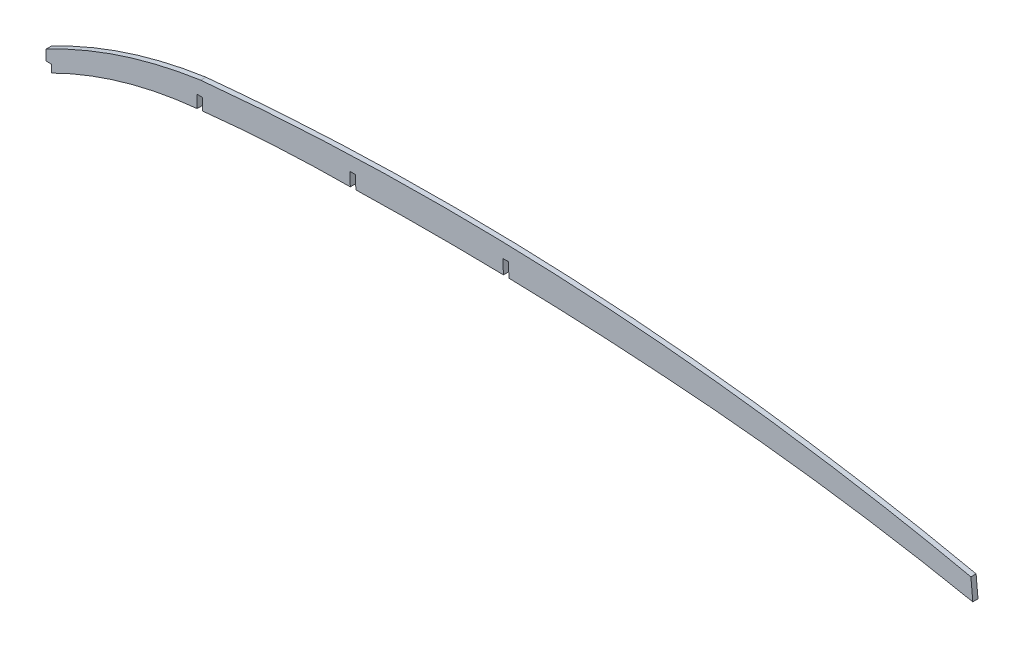
ISO-10303-21;
HEADER;
FILE_DESCRIPTION(('STEP AP214'),'2;1');
FILE_NAME('part.step','',(''),(''),'','','');
FILE_SCHEMA(('AUTOMOTIVE_DESIGN { 1 0 10303 214 1 1 1 1 }'));
ENDSEC;
DATA;
#1=APPLICATION_CONTEXT('core data for automotive mechanical design processes');
#2=APPLICATION_PROTOCOL_DEFINITION('international standard','automotive_design',2000,#1);
#3=PRODUCT_CONTEXT('',#1,'mechanical');
#4=PRODUCT('Part','Part','',(#3));
#5=PRODUCT_RELATED_PRODUCT_CATEGORY('part','',(#4));
#6=PRODUCT_DEFINITION_FORMATION('','',#4);
#7=PRODUCT_DEFINITION_CONTEXT('part definition',#1,'design');
#8=PRODUCT_DEFINITION('design','',#6,#7);
#9=PRODUCT_DEFINITION_SHAPE('','',#8);
#10=(LENGTH_UNIT() NAMED_UNIT(*) SI_UNIT(.MILLI.,.METRE.));
#11=(NAMED_UNIT(*) PLANE_ANGLE_UNIT() SI_UNIT($,.RADIAN.));
#12=(NAMED_UNIT(*) SI_UNIT($,.STERADIAN.) SOLID_ANGLE_UNIT());
#13=UNCERTAINTY_MEASURE_WITH_UNIT(LENGTH_MEASURE(1.E-05),#10,'distance_accuracy_value','');
#14=(GEOMETRIC_REPRESENTATION_CONTEXT(3) GLOBAL_UNCERTAINTY_ASSIGNED_CONTEXT((#13)) GLOBAL_UNIT_ASSIGNED_CONTEXT((#10,
#11,#12)) REPRESENTATION_CONTEXT('',''));
#15=CARTESIAN_POINT('',(0.,0.,0.));
#16=DIRECTION('',(0.,0.,1.));
#17=DIRECTION('',(1.,0.,0.));
#18=AXIS2_PLACEMENT_3D('',#15,#16,#17);
#19=CARTESIAN_POINT('',(236.842908731336,-1854.33256999703,-1.5875));
#20=DIRECTION('',(0.,0.,1.));
#21=DIRECTION('',(1.,0.,0.));
#22=AXIS2_PLACEMENT_3D('',#19,#20,#21);
#23=CYLINDRICAL_SURFACE('',#22,1973.72186122721);
#24=DIRECTION('',(0.,0.,1.));
#25=VECTOR('',#24,1.);
#26=CARTESIAN_POINT('',(189.230121553562,118.814917643811,-1.5875));
#27=LINE('',#26,#25);
#28=CARTESIAN_POINT('',(189.230121553562,118.814917643811,-1.5875));
#29=VERTEX_POINT('',#28);
#30=CARTESIAN_POINT('',(189.230121553562,118.814917643811,1.5875));
#31=VERTEX_POINT('',#30);
#32=EDGE_CURVE('E61',#29,#31,#27,.T.);
#33=ORIENTED_EDGE('',*,*,#32,.F.);
#34=CARTESIAN_POINT('',(236.842908731336,-1854.33256999703,-1.5875));
#35=DIRECTION('',(0.,0.,1.));
#36=DIRECTION('',(1.,0.,0.));
#37=AXIS2_PLACEMENT_3D('',#34,#35,#36);
#38=CIRCLE('',#37,1973.72186122721);
#39=CARTESIAN_POINT('',(279.388983423048,118.930670681853,-1.5875));
#40=VERTEX_POINT('',#39);
#41=EDGE_CURVE('E430',#29,#40,#38,.F.);
#42=ORIENTED_EDGE('',*,*,#41,.T.);
#43=DIRECTION('',(0.,0.,1.));
#44=VECTOR('',#43,1.);
#45=CARTESIAN_POINT('',(279.388983423048,118.930670681852,-1.5875));
#46=LINE('',#45,#44);
#47=CARTESIAN_POINT('',(279.388983423048,118.930670681853,1.5875));
#48=VERTEX_POINT('',#47);
#49=EDGE_CURVE('E238',#48,#40,#46,.F.);
#50=ORIENTED_EDGE('',*,*,#49,.F.);
#51=CARTESIAN_POINT('',(236.842908731336,-1854.33256999703,1.5875));
#52=DIRECTION('',(0.,0.,1.));
#53=DIRECTION('',(1.,0.,0.));
#54=AXIS2_PLACEMENT_3D('',#51,#52,#53);
#55=CIRCLE('',#54,1973.72186122721);
#56=EDGE_CURVE('E346',#31,#48,#55,.F.);
#57=ORIENTED_EDGE('',*,*,#56,.F.);
#58=EDGE_LOOP('',(#33,#42,#50,#57));
#59=FACE_BOUND('',#58,.T.);
#60=ADVANCED_FACE('F38',(#59),#23,.F.);
#61=CARTESIAN_POINT('',(569.494875015018,51.9104708992244,-1.5875));
#62=DIRECTION('',(0.995871386262185,0.0907754483560017,0.));
#63=DIRECTION('',(-0.0907754483560017,0.995871386262185,0.));
#64=AXIS2_PLACEMENT_3D('',#61,#62,#63);
#65=PLANE('',#64);
#66=DIRECTION('',(-0.0907754483560017,0.995871386262185,0.));
#67=VECTOR('',#66,1.);
#68=CARTESIAN_POINT('',(569.494875015018,51.9104708992244,1.5875));
#69=LINE('',#68,#67);
#70=CARTESIAN_POINT('',(566.085246421807,89.3165274404584,1.5875));
#71=VERTEX_POINT('',#70);
#72=CARTESIAN_POINT('',(564.932089986396,101.967475672689,1.5875));
#73=VERTEX_POINT('',#72);
#74=EDGE_CURVE('E269',#71,#73,#69,.T.);
#75=ORIENTED_EDGE('',*,*,#74,.F.);
#76=DIRECTION('',(0.,0.,1.));
#77=VECTOR('',#76,1.);
#78=CARTESIAN_POINT('',(566.085246421807,89.3165274404584,-1.5875));
#79=LINE('',#78,#77);
#80=CARTESIAN_POINT('',(566.085246421807,89.3165274404584,-1.5875));
#81=VERTEX_POINT('',#80);
#82=EDGE_CURVE('E318',#81,#71,#79,.T.);
#83=ORIENTED_EDGE('',*,*,#82,.F.);
#84=DIRECTION('',(-0.0907754483560017,0.995871386262185,0.));
#85=VECTOR('',#84,1.);
#86=CARTESIAN_POINT('',(569.494875015018,51.9104708992244,-1.5875));
#87=LINE('',#86,#85);
#88=CARTESIAN_POINT('',(564.932089986396,101.967475672689,-1.5875));
#89=VERTEX_POINT('',#88);
#90=EDGE_CURVE('E354',#81,#89,#87,.T.);
#91=ORIENTED_EDGE('',*,*,#90,.T.);
#92=DIRECTION('',(0.,0.,1.));
#93=VECTOR('',#92,1.);
#94=CARTESIAN_POINT('',(564.932089986396,101.967475672689,-1.5875));
#95=LINE('',#94,#93);
#96=EDGE_CURVE('E366',#89,#73,#95,.T.);
#97=ORIENTED_EDGE('',*,*,#96,.T.);
#98=EDGE_LOOP('',(#75,#83,#91,#97));
#99=FACE_BOUND('',#98,.T.);
#100=ADVANCED_FACE('F40',(#99),#65,.T.);
#101=CARTESIAN_POINT('',(283.231887302239,-1315.95982074918,-1.5875));
#102=DIRECTION('',(0.,0.,1.));
#103=DIRECTION('',(1.,0.,0.));
#104=AXIS2_PLACEMENT_3D('',#101,#102,#103);
#105=CYLINDRICAL_SURFACE('',#104,1433.46002300254);
#106=CARTESIAN_POINT('',(283.231887302239,-1315.95982074918,1.5875));
#107=DIRECTION('',(0.,0.,1.));
#108=DIRECTION('',(1.,0.,0.));
#109=AXIS2_PLACEMENT_3D('',#106,#107,#108);
#110=CIRCLE('',#109,1433.46002300254);
#111=CARTESIAN_POINT('',(373.10105505159,114.680305290374,1.5875));
#112=VERTEX_POINT('',#111);
#113=EDGE_CURVE('E351',#112,#71,#110,.F.);
#114=ORIENTED_EDGE('',*,*,#113,.F.);
#115=DIRECTION('',(0.,0.,1.));
#116=VECTOR('',#115,1.);
#117=CARTESIAN_POINT('',(373.10105505159,114.680305290374,-1.5875));
#118=LINE('',#117,#116);
#119=CARTESIAN_POINT('',(373.10105505159,114.680305290374,-1.5875));
#120=VERTEX_POINT('',#119);
#121=EDGE_CURVE('E356',#120,#112,#118,.T.);
#122=ORIENTED_EDGE('',*,*,#121,.F.);
#123=CARTESIAN_POINT('',(283.231887302239,-1315.95982074918,-1.5875));
#124=DIRECTION('',(0.,0.,1.));
#125=DIRECTION('',(1.,0.,0.));
#126=AXIS2_PLACEMENT_3D('',#123,#124,#125);
#127=CIRCLE('',#126,1433.46002300254);
#128=EDGE_CURVE('E432',#120,#81,#127,.F.);
#129=ORIENTED_EDGE('',*,*,#128,.T.);
#130=ORIENTED_EDGE('',*,*,#82,.T.);
#131=EDGE_LOOP('',(#114,#122,#129,#130));
#132=FACE_BOUND('',#131,.T.);
#133=ADVANCED_FACE('F400',(#132),#105,.F.);
#134=DIRECTION('',(0.,0.,1.));
#135=VECTOR('',#134,1.);
#136=CARTESIAN_POINT('',(282.773576797099,118.854790396613,-1.5875));
#137=LINE('',#136,#135);
#138=CARTESIAN_POINT('',(282.773576797099,118.854790396613,-1.5875));
#139=VERTEX_POINT('',#138);
#140=CARTESIAN_POINT('',(282.773576797099,118.854790396613,1.5875));
#141=VERTEX_POINT('',#140);
#142=EDGE_CURVE('E53',#139,#141,#137,.T.);
#143=ORIENTED_EDGE('',*,*,#142,.F.);
#144=EDGE_CURVE('E433',#139,#120,#38,.F.);
#145=ORIENTED_EDGE('',*,*,#144,.T.);
#146=ORIENTED_EDGE('',*,*,#121,.T.);
#147=EDGE_CURVE('E343',#141,#112,#55,.F.);
#148=ORIENTED_EDGE('',*,*,#147,.F.);
#149=EDGE_LOOP('',(#143,#145,#146,#148));
#150=FACE_BOUND('',#149,.T.);
#151=ADVANCED_FACE('F403',(#150),#23,.F.);
#152=CARTESIAN_POINT('',(190.018097922331,-770.258799072111,-1.5875));
#153=DIRECTION('',(0.,0.,1.));
#154=DIRECTION('',(1.,0.,0.));
#155=AXIS2_PLACEMENT_3D('',#152,#153,#154);
#156=CYLINDRICAL_SURFACE('',#155,889.);
#157=DIRECTION('',(0.,0.,1.));
#158=VECTOR('',#157,1.);
#159=CARTESIAN_POINT('',(95.6690999999995,113.720423868707,-1.5875));
#160=LINE('',#159,#158);
#161=CARTESIAN_POINT('',(95.6690999999995,113.720423868707,-1.5875));
#162=VERTEX_POINT('',#161);
#163=CARTESIAN_POINT('',(95.6690999999995,113.720423868707,1.5875));
#164=VERTEX_POINT('',#163);
#165=EDGE_CURVE('E255',#162,#164,#160,.T.);
#166=ORIENTED_EDGE('',*,*,#165,.F.);
#167=CARTESIAN_POINT('',(190.018097922331,-770.258799072111,-1.5875));
#168=DIRECTION('',(0.,0.,1.));
#169=DIRECTION('',(1.,0.,0.));
#170=AXIS2_PLACEMENT_3D('',#167,#168,#169);
#171=CIRCLE('',#170,889.);
#172=CARTESIAN_POINT('',(185.852928875635,118.731443487847,-1.5875));
#173=VERTEX_POINT('',#172);
#174=EDGE_CURVE('E337',#162,#173,#171,.F.);
#175=ORIENTED_EDGE('',*,*,#174,.T.);
#176=DIRECTION('',(0.,0.,1.));
#177=VECTOR('',#176,1.);
#178=CARTESIAN_POINT('',(185.852928875635,118.731443487847,-1.5875));
#179=LINE('',#178,#177);
#180=CARTESIAN_POINT('',(185.852928875635,118.731443487847,1.5875));
#181=VERTEX_POINT('',#180);
#182=EDGE_CURVE('E250',#181,#173,#179,.F.);
#183=ORIENTED_EDGE('',*,*,#182,.F.);
#184=CARTESIAN_POINT('',(190.018097922331,-770.258799072111,1.5875));
#185=DIRECTION('',(0.,0.,1.));
#186=DIRECTION('',(1.,0.,0.));
#187=AXIS2_PLACEMENT_3D('',#184,#185,#186);
#188=CIRCLE('',#187,889.);
#189=EDGE_CURVE('E341',#164,#181,#188,.F.);
#190=ORIENTED_EDGE('',*,*,#189,.F.);
#191=EDGE_LOOP('',(#166,#175,#183,#190));
#192=FACE_BOUND('',#191,.T.);
#193=ADVANCED_FACE('F339',(#192),#156,.F.);
#194=CARTESIAN_POINT('',(117.154868986009,-139.425519966293,-1.5875));
#195=DIRECTION('',(0.,0.,1.));
#196=DIRECTION('',(1.,0.,0.));
#197=AXIS2_PLACEMENT_3D('',#194,#195,#196);
#198=CYLINDRICAL_SURFACE('',#197,254.);
#199=DIRECTION('',(0.,0.,1.));
#200=VECTOR('',#199,1.);
#201=CARTESIAN_POINT('',(3.3528,87.6539575179203,-1.5875));
#202=LINE('',#201,#200);
#203=CARTESIAN_POINT('',(3.3528,87.6539575179203,-1.5875));
#204=VERTEX_POINT('',#203);
#205=CARTESIAN_POINT('',(3.3528,87.6539575179203,1.5875));
#206=VERTEX_POINT('',#205);
#207=EDGE_CURVE('E190',#204,#206,#202,.T.);
#208=ORIENTED_EDGE('',*,*,#207,.F.);
#209=CARTESIAN_POINT('',(117.154868986009,-139.425519966293,-1.5875));
#210=DIRECTION('',(0.,0.,1.));
#211=DIRECTION('',(1.,0.,0.));
#212=AXIS2_PLACEMENT_3D('',#209,#210,#211);
#213=CIRCLE('',#212,254.);
#214=CARTESIAN_POINT('',(92.2908999999994,113.354588124242,-1.5875));
#215=VERTEX_POINT('',#214);
#216=EDGE_CURVE('E440',#204,#215,#213,.F.);
#217=ORIENTED_EDGE('',*,*,#216,.T.);
#218=DIRECTION('',(0.,0.,1.));
#219=VECTOR('',#218,1.);
#220=CARTESIAN_POINT('',(92.2908999999994,113.354588124242,-1.5875));
#221=LINE('',#220,#219);
#222=CARTESIAN_POINT('',(92.2908999999995,113.354588124242,1.5875));
#223=VERTEX_POINT('',#222);
#224=EDGE_CURVE('E263',#223,#215,#221,.F.);
#225=ORIENTED_EDGE('',*,*,#224,.F.);
#226=CARTESIAN_POINT('',(117.154868986009,-139.425519966293,1.5875));
#227=DIRECTION('',(0.,0.,1.));
#228=DIRECTION('',(1.,0.,0.));
#229=AXIS2_PLACEMENT_3D('',#226,#227,#228);
#230=CIRCLE('',#229,254.);
#231=EDGE_CURVE('E344',#206,#223,#230,.F.);
#232=ORIENTED_EDGE('',*,*,#231,.F.);
#233=EDGE_LOOP('',(#208,#217,#225,#232));
#234=FACE_BOUND('',#233,.T.);
#235=ADVANCED_FACE('F410',(#234),#198,.F.);
#236=CARTESIAN_POINT('',(-1.10532055054518E-12,0.,-1.5875));
#237=DIRECTION('',(1.,0.,0.));
#238=DIRECTION('',(0.,1.,0.));
#239=AXIS2_PLACEMENT_3D('',#236,#237,#238);
#240=PLANE('',#239);
#241=DIRECTION('',(0.,1.,0.));
#242=VECTOR('',#241,1.);
#243=CARTESIAN_POINT('',(-1.10532055054518E-12,0.,-1.5875));
#244=LINE('',#243,#242);
#245=CARTESIAN_POINT('',(0.,92.3686828044431,-1.5875));
#246=VERTEX_POINT('',#245);
#247=CARTESIAN_POINT('',(-1.06598757598775E-12,98.6502514090875,-1.5875));
#248=VERTEX_POINT('',#247);
#249=EDGE_CURVE('E274',#246,#248,#244,.T.);
#250=ORIENTED_EDGE('',*,*,#249,.F.);
#251=DIRECTION('',(0.,0.,1.));
#252=VECTOR('',#251,1.);
#253=CARTESIAN_POINT('',(0.,92.3686828044431,-1.5925));
#254=LINE('',#253,#252);
#255=CARTESIAN_POINT('',(0.,92.3686828044431,1.5875));
#256=VERTEX_POINT('',#255);
#257=EDGE_CURVE('E185',#246,#256,#254,.T.);
#258=ORIENTED_EDGE('',*,*,#257,.T.);
#259=DIRECTION('',(0.,1.,0.));
#260=VECTOR('',#259,1.);
#261=CARTESIAN_POINT('',(-1.10532055054518E-12,0.,1.5875));
#262=LINE('',#261,#260);
#263=CARTESIAN_POINT('',(-1.06598757598775E-12,98.6502514090875,1.5875));
#264=VERTEX_POINT('',#263);
#265=EDGE_CURVE('E197',#256,#264,#262,.T.);
#266=ORIENTED_EDGE('',*,*,#265,.T.);
#267=DIRECTION('',(0.,0.,1.));
#268=VECTOR('',#267,1.);
#269=CARTESIAN_POINT('',(-1.06598757598775E-12,98.6502514090875,-1.5875));
#270=LINE('',#269,#268);
#271=EDGE_CURVE('E359',#248,#264,#270,.T.);
#272=ORIENTED_EDGE('',*,*,#271,.F.);
#273=EDGE_LOOP('',(#250,#258,#266,#272));
#274=FACE_BOUND('',#273,.T.);
#275=ADVANCED_FACE('F412',(#274),#240,.F.);
#276=CARTESIAN_POINT('',(136.51719861133,-159.585037587816,-1.5875));
#277=DIRECTION('',(0.,0.,1.));
#278=DIRECTION('',(1.,0.,0.));
#279=AXIS2_PLACEMENT_3D('',#276,#277,#278);
#280=CYLINDRICAL_SURFACE('',#279,292.1);
#281=CARTESIAN_POINT('',(136.51719861133,-159.585037587816,1.5875));
#282=DIRECTION('',(0.,0.,1.));
#283=DIRECTION('',(1.,0.,0.));
#284=AXIS2_PLACEMENT_3D('',#281,#282,#283);
#285=CIRCLE('',#284,292.1);
#286=CARTESIAN_POINT('',(94.4926456918245,129.47610983936,1.5875));
#287=VERTEX_POINT('',#286);
#288=EDGE_CURVE('E310',#264,#287,#285,.F.);
#289=ORIENTED_EDGE('',*,*,#288,.T.);
#290=DIRECTION('',(0.,0.,1.));
#291=VECTOR('',#290,1.);
#292=CARTESIAN_POINT('',(94.4926456918245,129.47610983936,-1.5875));
#293=LINE('',#292,#291);
#294=CARTESIAN_POINT('',(94.4926456918245,129.47610983936,-1.5875));
#295=VERTEX_POINT('',#294);
#296=EDGE_CURVE('E361',#295,#287,#293,.T.);
#297=ORIENTED_EDGE('',*,*,#296,.F.);
#298=CARTESIAN_POINT('',(136.51719861133,-159.585037587816,-1.5875));
#299=DIRECTION('',(0.,0.,1.));
#300=DIRECTION('',(1.,0.,0.));
#301=AXIS2_PLACEMENT_3D('',#298,#299,#300);
#302=CIRCLE('',#301,292.1);
#303=EDGE_CURVE('E369',#248,#295,#302,.F.);
#304=ORIENTED_EDGE('',*,*,#303,.F.);
#305=ORIENTED_EDGE('',*,*,#271,.T.);
#306=EDGE_LOOP('',(#289,#297,#304,#305));
#307=FACE_BOUND('',#306,.T.);
#308=ADVANCED_FACE('F284',(#307),#280,.T.);
#309=CARTESIAN_POINT('',(564.932089986396,101.967475672689,-1.5875));
#310=CARTESIAN_POINT('',(526.305455218406,110.359053109562,-1.5875));
#311=CARTESIAN_POINT('',(487.40569380784,117.234860687108,-1.5875));
#312=CARTESIAN_POINT('',(438.439550098732,123.934721128219,-1.5875));
#313=CARTESIAN_POINT('',(428.624759846768,125.180263293887,-1.5875));
#314=CARTESIAN_POINT('',(408.99898404678,127.476820047344,-1.5875));
#315=CARTESIAN_POINT('',(399.184721149519,128.528373057943,-1.5875));
#316=CARTESIAN_POINT('',(369.737829991562,131.394440576112,-1.5875));
#317=CARTESIAN_POINT('',(350.101100843674,132.920474644781,-1.5875));
#318=CARTESIAN_POINT('',(291.174630326811,136.35313005289,-1.5875));
#319=CARTESIAN_POINT('',(251.86863030514,137.116022475784,-1.5875));
#320=CARTESIAN_POINT('',(173.213311456313,135.594508668347,-1.5875));
#321=CARTESIAN_POINT('',(133.863993721209,133.310179259376,-1.5875));
#322=CARTESIAN_POINT('',(94.4926456918245,129.47610983936,-1.5875));
#323=B_SPLINE_CURVE_WITH_KNOTS('',3,(#309,#310,#311,#312,#313,#314,#315,#316,#317,#318,#319,
#320,#321,#322),.UNSPECIFIED.,.F.,.F.,(4,2,2,2,2,2,4),(0.,0.25,0.3125,0.375,0.5,0.75,1.),.UNSPECIFIED.);
#324=DIRECTION('',(0.,0.,1.));
#325=VECTOR('',#324,1.);
#326=SURFACE_OF_LINEAR_EXTRUSION('',#323,#325);
#327=CARTESIAN_POINT('',(94.4926456918245,129.47610983936,1.5875));
#328=CARTESIAN_POINT('',(133.863993721209,133.310179259376,1.5875));
#329=CARTESIAN_POINT('',(173.213311456313,135.594508668347,1.5875));
#330=CARTESIAN_POINT('',(251.86863030514,137.116022475784,1.5875));
#331=CARTESIAN_POINT('',(291.174630326811,136.35313005289,1.5875));
#332=CARTESIAN_POINT('',(350.101100843674,132.920474644781,1.5875));
#333=CARTESIAN_POINT('',(369.737829991562,131.394440576112,1.5875));
#334=CARTESIAN_POINT('',(399.184721149519,128.528373057943,1.5875));
#335=CARTESIAN_POINT('',(408.99898404678,127.476820047344,1.5875));
#336=CARTESIAN_POINT('',(428.624759846768,125.180263293887,1.5875));
#337=CARTESIAN_POINT('',(438.439550098732,123.934721128219,1.5875));
#338=CARTESIAN_POINT('',(487.40569380784,117.234860687108,1.5875));
#339=CARTESIAN_POINT('',(526.305455218406,110.359053109562,1.5875));
#340=CARTESIAN_POINT('',(564.932089986396,101.967475672689,1.5875));
#341=B_SPLINE_CURVE_WITH_KNOTS('',3,(#327,#328,#329,#330,#331,#332,#333,#334,#335,#336,#337,
#338,#339,#340),.UNSPECIFIED.,.F.,.F.,(4,2,2,2,2,2,4),(0.,0.25,0.5,0.625,0.6875,0.75,1.),.UNSPECIFIED.);
#342=EDGE_CURVE('E307',#73,#287,#341,.F.);
#343=ORIENTED_EDGE('',*,*,#342,.F.);
#344=ORIENTED_EDGE('',*,*,#96,.F.);
#345=CARTESIAN_POINT('',(564.932089986396,101.967475672689,-1.5875));
#346=CARTESIAN_POINT('',(526.305455218406,110.359053109562,-1.5875));
#347=CARTESIAN_POINT('',(487.40569380784,117.234860687108,-1.5875));
#348=CARTESIAN_POINT('',(438.439550098732,123.934721128219,-1.5875));
#349=CARTESIAN_POINT('',(428.624759846768,125.180263293887,-1.5875));
#350=CARTESIAN_POINT('',(408.99898404678,127.476820047344,-1.5875));
#351=CARTESIAN_POINT('',(399.184721149519,128.528373057943,-1.5875));
#352=CARTESIAN_POINT('',(369.737829991562,131.394440576112,-1.5875));
#353=CARTESIAN_POINT('',(350.101100843674,132.920474644781,-1.5875));
#354=CARTESIAN_POINT('',(291.174630326811,136.35313005289,-1.5875));
#355=CARTESIAN_POINT('',(251.86863030514,137.116022475784,-1.5875));
#356=CARTESIAN_POINT('',(173.213311456313,135.594508668347,-1.5875));
#357=CARTESIAN_POINT('',(133.863993721209,133.310179259376,-1.5875));
#358=CARTESIAN_POINT('',(94.4926456918245,129.47610983936,-1.5875));
#359=B_SPLINE_CURVE_WITH_KNOTS('',3,(#345,#346,#347,#348,#349,#350,#351,#352,#353,#354,#355,
#356,#357,#358),.UNSPECIFIED.,.F.,.F.,(4,2,2,2,2,2,4),(0.,0.25,0.3125,0.375,0.5,0.75,1.),.UNSPECIFIED.);
#360=EDGE_CURVE('E364',#89,#295,#359,.T.);
#361=ORIENTED_EDGE('',*,*,#360,.T.);
#362=ORIENTED_EDGE('',*,*,#296,.T.);
#363=EDGE_LOOP('',(#343,#344,#361,#362));
#364=FACE_BOUND('',#363,.T.);
#365=ADVANCED_FACE('F279',(#364),#326,.T.);
#366=CARTESIAN_POINT('',(0.,0.,-1.5875));
#367=DIRECTION('',(0.,0.,1.));
#368=DIRECTION('',(1.,0.,0.));
#369=AXIS2_PLACEMENT_3D('',#366,#367,#368);
#370=PLANE('',#369);
#371=DIRECTION('',(0.,1.,0.));
#372=VECTOR('',#371,1.);
#373=CARTESIAN_POINT('',(3.35280000000001,0.,-1.5875));
#374=LINE('',#373,#372);
#375=CARTESIAN_POINT('',(3.35280000000001,92.3686828044431,-1.5875));
#376=VERTEX_POINT('',#375);
#377=EDGE_CURVE('E265',#204,#376,#374,.T.);
#378=ORIENTED_EDGE('',*,*,#377,.T.);
#379=DIRECTION('',(-1.,0.,0.));
#380=VECTOR('',#379,1.);
#381=CARTESIAN_POINT('',(0.,92.3686828044431,-1.5875));
#382=LINE('',#381,#380);
#383=EDGE_CURVE('E182',#376,#246,#382,.T.);
#384=ORIENTED_EDGE('',*,*,#383,.T.);
#385=ORIENTED_EDGE('',*,*,#249,.T.);
#386=ORIENTED_EDGE('',*,*,#303,.T.);
#387=ORIENTED_EDGE('',*,*,#360,.F.);
#388=ORIENTED_EDGE('',*,*,#90,.F.);
#389=ORIENTED_EDGE('',*,*,#128,.F.);
#390=ORIENTED_EDGE('',*,*,#144,.F.);
#391=DIRECTION('',(-0.0430000788379942,0.999075068861157,0.));
#392=VECTOR('',#391,1.);
#393=CARTESIAN_POINT('',(287.356764787681,12.3678029065286,-1.5875));
#394=LINE('',#393,#392);
#395=CARTESIAN_POINT('',(282.398848571844,127.561323909296,-1.5875));
#396=VERTEX_POINT('',#395);
#397=EDGE_CURVE('E203',#139,#396,#394,.T.);
#398=ORIENTED_EDGE('',*,*,#397,.T.);
#399=DIRECTION('',(-0.999075068861157,-0.0430000788379941,0.));
#400=VECTOR('',#399,1.);
#401=CARTESIAN_POINT('',(-4.95791621583694,115.193521002768,-1.5875));
#402=LINE('',#401,#400);
#403=CARTESIAN_POINT('',(279.023773174217,127.416061042966,-1.5875));
#404=VERTEX_POINT('',#403);
#405=EDGE_CURVE('E232',#396,#404,#402,.T.);
#406=ORIENTED_EDGE('',*,*,#405,.T.);
#407=DIRECTION('',(0.0430000788379986,-0.999075068861157,0.));
#408=VECTOR('',#407,1.);
#409=CARTESIAN_POINT('',(283.981689390055,12.2225400401993,-1.5875));
#410=LINE('',#409,#408);
#411=EDGE_CURVE('E235',#404,#40,#410,.T.);
#412=ORIENTED_EDGE('',*,*,#411,.T.);
#413=ORIENTED_EDGE('',*,*,#41,.F.);
#414=DIRECTION('',(-0.0209302977679262,0.999780937323445,0.));
#415=VECTOR('',#414,1.);
#416=CARTESIAN_POINT('',(191.633510954167,4.01182528776927,-1.5875));
#417=LINE('',#416,#415);
#418=CARTESIAN_POINT('',(189.061851111532,126.852719213662,-1.5875));
#419=VERTEX_POINT('',#418);
#420=EDGE_CURVE('E240',#29,#419,#417,.T.);
#421=ORIENTED_EDGE('',*,*,#420,.T.);
#422=DIRECTION('',(-0.999780937323445,-0.0209302977679275,0.));
#423=VECTOR('',#422,1.);
#424=CARTESIAN_POINT('',(-2.57165984263564,122.840893925892,-1.5875));
#425=LINE('',#424,#423);
#426=CARTESIAN_POINT('',(185.684391149066,126.782012481742,-1.5875));
#427=VERTEX_POINT('',#426);
#428=EDGE_CURVE('E244',#419,#427,#425,.T.);
#429=ORIENTED_EDGE('',*,*,#428,.T.);
#430=DIRECTION('',(0.0209302977679284,-0.999780937323445,0.));
#431=VECTOR('',#430,1.);
#432=CARTESIAN_POINT('',(188.256050991702,3.94111855585009,-1.5875));
#433=LINE('',#432,#431);
#434=EDGE_CURVE('E247',#427,#173,#433,.T.);
#435=ORIENTED_EDGE('',*,*,#434,.T.);
#436=ORIENTED_EDGE('',*,*,#174,.F.);
#437=DIRECTION('',(0.,1.,0.));
#438=VECTOR('',#437,1.);
#439=CARTESIAN_POINT('',(95.6690999999913,-6.89973078671294E-12,-1.5875));
#440=LINE('',#439,#438);
#441=CARTESIAN_POINT('',(95.6691,120.90872278071,-1.5875));
#442=VERTEX_POINT('',#441);
#443=EDGE_CURVE('E252',#162,#442,#440,.T.);
#444=ORIENTED_EDGE('',*,*,#443,.T.);
#445=DIRECTION('',(-1.,0.,0.));
#446=VECTOR('',#445,1.);
#447=CARTESIAN_POINT('',(0.,120.90872278071,-1.5875));
#448=LINE('',#447,#446);
#449=CARTESIAN_POINT('',(92.2909,120.90872278071,-1.5875));
#450=VERTEX_POINT('',#449);
#451=EDGE_CURVE('E257',#442,#450,#448,.T.);
#452=ORIENTED_EDGE('',*,*,#451,.T.);
#453=DIRECTION('',(0.,-1.,0.));
#454=VECTOR('',#453,1.);
#455=CARTESIAN_POINT('',(92.290899999991,-6.85779211195769E-12,-1.5875));
#456=LINE('',#455,#454);
#457=EDGE_CURVE('E260',#450,#215,#456,.T.);
#458=ORIENTED_EDGE('',*,*,#457,.T.);
#459=ORIENTED_EDGE('',*,*,#216,.F.);
#460=EDGE_LOOP('',(#378,#384,#385,#386,#387,#388,#389,#390,#398,#406,#412,#413,#421,#429,#435,
#436,#444,#452,#458,#459));
#461=FACE_BOUND('',#460,.T.);
#462=ADVANCED_FACE('F283',(#461),#370,.F.);
#463=CARTESIAN_POINT('',(0.,0.,1.5875));
#464=DIRECTION('',(0.,0.,1.));
#465=DIRECTION('',(1.,0.,0.));
#466=AXIS2_PLACEMENT_3D('',#463,#464,#465);
#467=PLANE('',#466);
#468=DIRECTION('',(-1.,0.,0.));
#469=VECTOR('',#468,1.);
#470=CARTESIAN_POINT('',(0.,92.3686828044431,1.5875));
#471=LINE('',#470,#469);
#472=CARTESIAN_POINT('',(3.35280000000001,92.3686828044431,1.5875));
#473=VERTEX_POINT('',#472);
#474=EDGE_CURVE('E179',#473,#256,#471,.T.);
#475=ORIENTED_EDGE('',*,*,#474,.F.);
#476=DIRECTION('',(0.,1.,0.));
#477=VECTOR('',#476,1.);
#478=CARTESIAN_POINT('',(3.35280000000001,0.,1.5875));
#479=LINE('',#478,#477);
#480=EDGE_CURVE('E11',#206,#473,#479,.T.);
#481=ORIENTED_EDGE('',*,*,#480,.F.);
#482=ORIENTED_EDGE('',*,*,#231,.T.);
#483=DIRECTION('',(0.,-1.,0.));
#484=VECTOR('',#483,1.);
#485=CARTESIAN_POINT('',(92.2909,120.90872278071,1.5875));
#486=LINE('',#485,#484);
#487=CARTESIAN_POINT('',(92.2909,120.90872278071,1.5875));
#488=VERTEX_POINT('',#487);
#489=EDGE_CURVE('E198',#488,#223,#486,.T.);
#490=ORIENTED_EDGE('',*,*,#489,.F.);
#491=DIRECTION('',(-1.,0.,0.));
#492=VECTOR('',#491,1.);
#493=CARTESIAN_POINT('',(92.2909,120.90872278071,1.5875));
#494=LINE('',#493,#492);
#495=CARTESIAN_POINT('',(95.6691,120.90872278071,1.5875));
#496=VERTEX_POINT('',#495);
#497=EDGE_CURVE('E200',#496,#488,#494,.T.);
#498=ORIENTED_EDGE('',*,*,#497,.F.);
#499=DIRECTION('',(0.,1.,0.));
#500=VECTOR('',#499,1.);
#501=CARTESIAN_POINT('',(95.6690999999913,-6.89973078671294E-12,1.5875));
#502=LINE('',#501,#500);
#503=EDGE_CURVE('E46',#164,#496,#502,.T.);
#504=ORIENTED_EDGE('',*,*,#503,.F.);
#505=ORIENTED_EDGE('',*,*,#189,.T.);
#506=DIRECTION('',(0.0209302977679284,-0.999780937323445,0.));
#507=VECTOR('',#506,1.);
#508=CARTESIAN_POINT('',(185.684391149066,126.782012481742,1.5875));
#509=LINE('',#508,#507);
#510=CARTESIAN_POINT('',(185.684391149066,126.782012481742,1.5875));
#511=VERTEX_POINT('',#510);
#512=EDGE_CURVE('E209',#511,#181,#509,.T.);
#513=ORIENTED_EDGE('',*,*,#512,.F.);
#514=DIRECTION('',(-0.999780937323445,-0.0209302977679275,0.));
#515=VECTOR('',#514,1.);
#516=CARTESIAN_POINT('',(185.684391149066,126.782012481742,1.5875));
#517=LINE('',#516,#515);
#518=CARTESIAN_POINT('',(189.061851111532,126.852719213662,1.5875));
#519=VERTEX_POINT('',#518);
#520=EDGE_CURVE('E214',#519,#511,#517,.T.);
#521=ORIENTED_EDGE('',*,*,#520,.F.);
#522=DIRECTION('',(-0.0209302977679262,0.999780937323445,0.));
#523=VECTOR('',#522,1.);
#524=CARTESIAN_POINT('',(191.633510954167,4.01182528776927,1.5875));
#525=LINE('',#524,#523);
#526=EDGE_CURVE('E317',#31,#519,#525,.T.);
#527=ORIENTED_EDGE('',*,*,#526,.F.);
#528=ORIENTED_EDGE('',*,*,#56,.T.);
#529=DIRECTION('',(0.0430000788379986,-0.999075068861157,0.));
#530=VECTOR('',#529,1.);
#531=CARTESIAN_POINT('',(279.023773174217,127.416061042966,1.5875));
#532=LINE('',#531,#530);
#533=CARTESIAN_POINT('',(279.023773174217,127.416061042966,1.5875));
#534=VERTEX_POINT('',#533);
#535=EDGE_CURVE('E217',#534,#48,#532,.T.);
#536=ORIENTED_EDGE('',*,*,#535,.F.);
#537=DIRECTION('',(-0.999075068861157,-0.0430000788379941,0.));
#538=VECTOR('',#537,1.);
#539=CARTESIAN_POINT('',(279.023773174217,127.416061042966,1.5875));
#540=LINE('',#539,#538);
#541=CARTESIAN_POINT('',(282.398848571844,127.561323909296,1.5875));
#542=VERTEX_POINT('',#541);
#543=EDGE_CURVE('E223',#542,#534,#540,.T.);
#544=ORIENTED_EDGE('',*,*,#543,.F.);
#545=DIRECTION('',(-0.0430000788379942,0.999075068861157,0.));
#546=VECTOR('',#545,1.);
#547=CARTESIAN_POINT('',(287.356764787681,12.3678029065286,1.5875));
#548=LINE('',#547,#546);
#549=EDGE_CURVE('E315',#141,#542,#548,.T.);
#550=ORIENTED_EDGE('',*,*,#549,.F.);
#551=ORIENTED_EDGE('',*,*,#147,.T.);
#552=ORIENTED_EDGE('',*,*,#113,.T.);
#553=ORIENTED_EDGE('',*,*,#74,.T.);
#554=ORIENTED_EDGE('',*,*,#342,.T.);
#555=ORIENTED_EDGE('',*,*,#288,.F.);
#556=ORIENTED_EDGE('',*,*,#265,.F.);
#557=EDGE_LOOP('',(#475,#481,#482,#490,#498,#504,#505,#513,#521,#527,#528,#536,#544,#550,#551,
#552,#553,#554,#555,#556));
#558=FACE_BOUND('',#557,.T.);
#559=ADVANCED_FACE('F195',(#558),#467,.T.);
#560=CARTESIAN_POINT('',(279.023773174217,127.416061042966,-1.5925));
#561=DIRECTION('',(-0.0430000788379941,0.999075068861157,0.));
#562=DIRECTION('',(-0.999075068861157,-0.0430000788379941,0.));
#563=AXIS2_PLACEMENT_3D('',#560,#561,#562);
#564=PLANE('',#563);
#565=DIRECTION('',(0.,0.,1.));
#566=VECTOR('',#565,1.);
#567=CARTESIAN_POINT('',(282.398848571844,127.561323909296,-1.5925));
#568=LINE('',#567,#566);
#569=EDGE_CURVE('E221',#396,#542,#568,.T.);
#570=ORIENTED_EDGE('',*,*,#569,.T.);
#571=ORIENTED_EDGE('',*,*,#543,.T.);
#572=DIRECTION('',(0.,0.,1.));
#573=VECTOR('',#572,1.);
#574=CARTESIAN_POINT('',(279.023773174217,127.416061042966,-1.5925));
#575=LINE('',#574,#573);
#576=EDGE_CURVE('E224',#404,#534,#575,.T.);
#577=ORIENTED_EDGE('',*,*,#576,.F.);
#578=ORIENTED_EDGE('',*,*,#405,.F.);
#579=EDGE_LOOP('',(#570,#571,#577,#578));
#580=FACE_BOUND('',#579,.T.);
#581=ADVANCED_FACE('F397',(#580),#564,.F.);
#582=CARTESIAN_POINT('',(279.023773174217,127.416061042966,-1.5925));
#583=DIRECTION('',(-0.999075068861157,-0.0430000788379986,0.));
#584=DIRECTION('',(0.0430000788379986,-0.999075068861157,0.));
#585=AXIS2_PLACEMENT_3D('',#582,#583,#584);
#586=PLANE('',#585);
#587=ORIENTED_EDGE('',*,*,#49,.T.);
#588=ORIENTED_EDGE('',*,*,#411,.F.);
#589=ORIENTED_EDGE('',*,*,#576,.T.);
#590=ORIENTED_EDGE('',*,*,#535,.T.);
#591=EDGE_LOOP('',(#587,#588,#589,#590));
#592=FACE_BOUND('',#591,.T.);
#593=ADVANCED_FACE('F467',(#592),#586,.F.);
#594=CARTESIAN_POINT('',(282.398848571844,127.561323909296,-1.5925));
#595=DIRECTION('',(0.999075068861157,0.0430000788379942,0.));
#596=DIRECTION('',(-0.0430000788379942,0.999075068861157,0.));
#597=AXIS2_PLACEMENT_3D('',#594,#595,#596);
#598=PLANE('',#597);
#599=ORIENTED_EDGE('',*,*,#142,.T.);
#600=ORIENTED_EDGE('',*,*,#549,.T.);
#601=ORIENTED_EDGE('',*,*,#569,.F.);
#602=ORIENTED_EDGE('',*,*,#397,.F.);
#603=EDGE_LOOP('',(#599,#600,#601,#602));
#604=FACE_BOUND('',#603,.T.);
#605=ADVANCED_FACE('F465',(#604),#598,.F.);
#606=CARTESIAN_POINT('',(185.684391149066,126.782012481742,-1.5925));
#607=DIRECTION('',(-0.0209302977679275,0.999780937323445,0.));
#608=DIRECTION('',(-0.999780937323445,-0.0209302977679275,0.));
#609=AXIS2_PLACEMENT_3D('',#606,#607,#608);
#610=PLANE('',#609);
#611=DIRECTION('',(0.,0.,1.));
#612=VECTOR('',#611,1.);
#613=CARTESIAN_POINT('',(189.061851111532,126.852719213662,-1.5925));
#614=LINE('',#613,#612);
#615=EDGE_CURVE('E212',#419,#519,#614,.T.);
#616=ORIENTED_EDGE('',*,*,#615,.T.);
#617=ORIENTED_EDGE('',*,*,#520,.T.);
#618=DIRECTION('',(0.,0.,1.));
#619=VECTOR('',#618,1.);
#620=CARTESIAN_POINT('',(185.684391149066,126.782012481742,-1.5925));
#621=LINE('',#620,#619);
#622=EDGE_CURVE('E215',#427,#511,#621,.T.);
#623=ORIENTED_EDGE('',*,*,#622,.F.);
#624=ORIENTED_EDGE('',*,*,#428,.F.);
#625=EDGE_LOOP('',(#616,#617,#623,#624));
#626=FACE_BOUND('',#625,.T.);
#627=ADVANCED_FACE('F459',(#626),#610,.F.);
#628=CARTESIAN_POINT('',(185.684391149066,126.782012481742,-1.5925));
#629=DIRECTION('',(-0.999780937323445,-0.0209302977679284,0.));
#630=DIRECTION('',(0.0209302977679284,-0.999780937323445,0.));
#631=AXIS2_PLACEMENT_3D('',#628,#629,#630);
#632=PLANE('',#631);
#633=ORIENTED_EDGE('',*,*,#182,.T.);
#634=ORIENTED_EDGE('',*,*,#434,.F.);
#635=ORIENTED_EDGE('',*,*,#622,.T.);
#636=ORIENTED_EDGE('',*,*,#512,.T.);
#637=EDGE_LOOP('',(#633,#634,#635,#636));
#638=FACE_BOUND('',#637,.T.);
#639=ADVANCED_FACE('F456',(#638),#632,.F.);
#640=CARTESIAN_POINT('',(189.061851111532,126.852719213662,-1.5925));
#641=DIRECTION('',(0.999780937323445,0.0209302977679262,0.));
#642=DIRECTION('',(-0.0209302977679262,0.999780937323445,0.));
#643=AXIS2_PLACEMENT_3D('',#640,#641,#642);
#644=PLANE('',#643);
#645=ORIENTED_EDGE('',*,*,#32,.T.);
#646=ORIENTED_EDGE('',*,*,#526,.T.);
#647=ORIENTED_EDGE('',*,*,#615,.F.);
#648=ORIENTED_EDGE('',*,*,#420,.F.);
#649=EDGE_LOOP('',(#645,#646,#647,#648));
#650=FACE_BOUND('',#649,.T.);
#651=ADVANCED_FACE('F451',(#650),#644,.F.);
#652=CARTESIAN_POINT('',(92.2909,120.90872278071,-1.5925));
#653=DIRECTION('',(0.,1.,0.));
#654=DIRECTION('',(0.,0.,1.));
#655=AXIS2_PLACEMENT_3D('',#652,#653,#654);
#656=PLANE('',#655);
#657=DIRECTION('',(0.,0.,1.));
#658=VECTOR('',#657,1.);
#659=CARTESIAN_POINT('',(95.6691,120.90872278071,-1.5925));
#660=LINE('',#659,#658);
#661=EDGE_CURVE('E205',#442,#496,#660,.T.);
#662=ORIENTED_EDGE('',*,*,#661,.T.);
#663=ORIENTED_EDGE('',*,*,#497,.T.);
#664=DIRECTION('',(0.,0.,1.));
#665=VECTOR('',#664,1.);
#666=CARTESIAN_POINT('',(92.2909,120.90872278071,-1.5925));
#667=LINE('',#666,#665);
#668=EDGE_CURVE('E207',#450,#488,#667,.T.);
#669=ORIENTED_EDGE('',*,*,#668,.F.);
#670=ORIENTED_EDGE('',*,*,#451,.F.);
#671=EDGE_LOOP('',(#662,#663,#669,#670));
#672=FACE_BOUND('',#671,.T.);
#673=ADVANCED_FACE('F331',(#672),#656,.F.);
#674=CARTESIAN_POINT('',(92.2909,120.90872278071,-1.5925));
#675=DIRECTION('',(-1.,0.,0.));
#676=DIRECTION('',(0.,-1.,0.));
#677=AXIS2_PLACEMENT_3D('',#674,#675,#676);
#678=PLANE('',#677);
#679=ORIENTED_EDGE('',*,*,#224,.T.);
#680=ORIENTED_EDGE('',*,*,#457,.F.);
#681=ORIENTED_EDGE('',*,*,#668,.T.);
#682=ORIENTED_EDGE('',*,*,#489,.T.);
#683=EDGE_LOOP('',(#679,#680,#681,#682));
#684=FACE_BOUND('',#683,.T.);
#685=ADVANCED_FACE('F443',(#684),#678,.F.);
#686=CARTESIAN_POINT('',(95.6691,120.90872278071,-1.5925));
#687=DIRECTION('',(1.,0.,0.));
#688=DIRECTION('',(0.,1.,0.));
#689=AXIS2_PLACEMENT_3D('',#686,#687,#688);
#690=PLANE('',#689);
#691=ORIENTED_EDGE('',*,*,#165,.T.);
#692=ORIENTED_EDGE('',*,*,#503,.T.);
#693=ORIENTED_EDGE('',*,*,#661,.F.);
#694=ORIENTED_EDGE('',*,*,#443,.F.);
#695=EDGE_LOOP('',(#691,#692,#693,#694));
#696=FACE_BOUND('',#695,.T.);
#697=ADVANCED_FACE('F324',(#696),#690,.F.);
#698=CARTESIAN_POINT('',(0.,92.3686828044431,-1.5925));
#699=DIRECTION('',(0.,1.,0.));
#700=DIRECTION('',(0.,0.,1.));
#701=AXIS2_PLACEMENT_3D('',#698,#699,#700);
#702=PLANE('',#701);
#703=DIRECTION('',(0.,0.,1.));
#704=VECTOR('',#703,1.);
#705=CARTESIAN_POINT('',(3.35280000000001,92.3686828044431,-1.5925));
#706=LINE('',#705,#704);
#707=EDGE_CURVE('E176',#376,#473,#706,.T.);
#708=ORIENTED_EDGE('',*,*,#707,.T.);
#709=ORIENTED_EDGE('',*,*,#474,.T.);
#710=ORIENTED_EDGE('',*,*,#257,.F.);
#711=ORIENTED_EDGE('',*,*,#383,.F.);
#712=EDGE_LOOP('',(#708,#709,#710,#711));
#713=FACE_BOUND('',#712,.T.);
#714=ADVANCED_FACE('F177',(#713),#702,.F.);
#715=CARTESIAN_POINT('',(3.35280000000001,85.9424828044431,-1.5925));
#716=DIRECTION('',(1.,0.,0.));
#717=DIRECTION('',(0.,0.,-1.));
#718=AXIS2_PLACEMENT_3D('',#715,#716,#717);
#719=PLANE('',#718);
#720=ORIENTED_EDGE('',*,*,#207,.T.);
#721=ORIENTED_EDGE('',*,*,#480,.T.);
#722=ORIENTED_EDGE('',*,*,#707,.F.);
#723=ORIENTED_EDGE('',*,*,#377,.F.);
#724=EDGE_LOOP('',(#720,#721,#722,#723));
#725=FACE_BOUND('',#724,.T.);
#726=ADVANCED_FACE('F188',(#725),#719,.F.);
#727=CLOSED_SHELL('',(#60,#100,#133,#151,#193,#235,#275,#308,#365,#462,#559,#581,#593,#605,#627,
#639,#651,#673,#685,#697,#714,#726));
#728=MANIFOLD_SOLID_BREP('B2',#727);
#729=ADVANCED_BREP_SHAPE_REPRESENTATION('',(#18,#728),#14);
#730=SHAPE_DEFINITION_REPRESENTATION(#9,#729);
ENDSEC;
END-ISO-10303-21;
